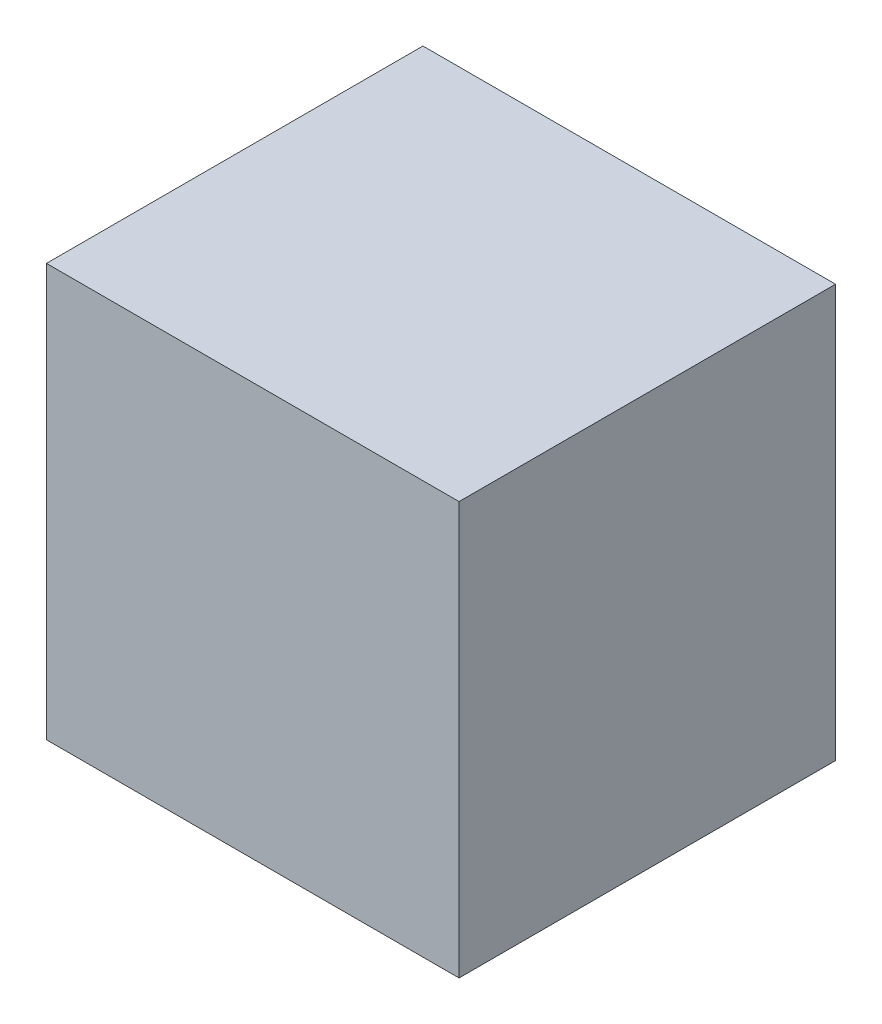
ISO-10303-21;
HEADER;
FILE_DESCRIPTION(('STEP AP214'),'2;1');
FILE_NAME('part.step','',(''),(''),'','','');
FILE_SCHEMA(('AUTOMOTIVE_DESIGN { 1 0 10303 214 1 1 1 1 }'));
ENDSEC;
DATA;
#1=APPLICATION_CONTEXT('core data for automotive mechanical design processes');
#2=APPLICATION_PROTOCOL_DEFINITION('international standard','automotive_design',2000,#1);
#3=PRODUCT_CONTEXT('',#1,'mechanical');
#4=PRODUCT('Part','Part','',(#3));
#5=PRODUCT_RELATED_PRODUCT_CATEGORY('part','',(#4));
#6=PRODUCT_DEFINITION_FORMATION('','',#4);
#7=PRODUCT_DEFINITION_CONTEXT('part definition',#1,'design');
#8=PRODUCT_DEFINITION('design','',#6,#7);
#9=PRODUCT_DEFINITION_SHAPE('','',#8);
#10=(LENGTH_UNIT() NAMED_UNIT(*) SI_UNIT(.MILLI.,.METRE.));
#11=(NAMED_UNIT(*) PLANE_ANGLE_UNIT() SI_UNIT($,.RADIAN.));
#12=(NAMED_UNIT(*) SI_UNIT($,.STERADIAN.) SOLID_ANGLE_UNIT());
#13=UNCERTAINTY_MEASURE_WITH_UNIT(LENGTH_MEASURE(1.E-05),#10,'distance_accuracy_value','');
#14=(GEOMETRIC_REPRESENTATION_CONTEXT(3) GLOBAL_UNCERTAINTY_ASSIGNED_CONTEXT((#13)) GLOBAL_UNIT_ASSIGNED_CONTEXT((#10,
#11,#12)) REPRESENTATION_CONTEXT('',''));
#15=CARTESIAN_POINT('',(0.,0.,0.));
#16=DIRECTION('',(0.,0.,1.));
#17=DIRECTION('',(1.,0.,0.));
#18=AXIS2_PLACEMENT_3D('',#15,#16,#17);
#19=CARTESIAN_POINT('',(0.,254.,0.));
#20=DIRECTION('',(1.,0.,0.));
#21=DIRECTION('',(0.,0.,-1.));
#22=AXIS2_PLACEMENT_3D('',#19,#20,#21);
#23=PLANE('',#22);
#24=DIRECTION('',(0.,0.,1.));
#25=VECTOR('',#24,1.);
#26=CARTESIAN_POINT('',(0.,0.,0.));
#27=LINE('',#26,#25);
#28=CARTESIAN_POINT('',(0.,0.,-231.775));
#29=VERTEX_POINT('',#28);
#30=CARTESIAN_POINT('',(0.,0.,0.));
#31=VERTEX_POINT('',#30);
#32=EDGE_CURVE('E96',#29,#31,#27,.T.);
#33=ORIENTED_EDGE('',*,*,#32,.T.);
#34=DIRECTION('',(0.,-1.,0.));
#35=VECTOR('',#34,1.);
#36=CARTESIAN_POINT('',(0.,254.,0.));
#37=LINE('',#36,#35);
#38=CARTESIAN_POINT('',(0.,254.,0.));
#39=VERTEX_POINT('',#38);
#40=EDGE_CURVE('E11',#39,#31,#37,.T.);
#41=ORIENTED_EDGE('',*,*,#40,.F.);
#42=DIRECTION('',(0.,0.,1.));
#43=VECTOR('',#42,1.);
#44=CARTESIAN_POINT('',(0.,254.,0.));
#45=LINE('',#44,#43);
#46=CARTESIAN_POINT('',(0.,254.,-231.775));
#47=VERTEX_POINT('',#46);
#48=EDGE_CURVE('E84',#47,#39,#45,.T.);
#49=ORIENTED_EDGE('',*,*,#48,.F.);
#50=DIRECTION('',(0.,-1.,0.));
#51=VECTOR('',#50,1.);
#52=CARTESIAN_POINT('',(0.,254.,-231.775));
#53=LINE('',#52,#51);
#54=EDGE_CURVE('E92',#47,#29,#53,.T.);
#55=ORIENTED_EDGE('',*,*,#54,.T.);
#56=EDGE_LOOP('',(#33,#41,#49,#55));
#57=FACE_BOUND('',#56,.T.);
#58=ADVANCED_FACE('F33',(#57),#23,.F.);
#59=CARTESIAN_POINT('',(0.,254.,0.));
#60=DIRECTION('',(0.,0.,-1.));
#61=DIRECTION('',(-1.,0.,0.));
#62=AXIS2_PLACEMENT_3D('',#59,#60,#61);
#63=PLANE('',#62);
#64=DIRECTION('',(1.,0.,0.));
#65=VECTOR('',#64,1.);
#66=CARTESIAN_POINT('',(0.,0.,0.));
#67=LINE('',#66,#65);
#68=CARTESIAN_POINT('',(254.,0.,0.));
#69=VERTEX_POINT('',#68);
#70=EDGE_CURVE('E88',#31,#69,#67,.T.);
#71=ORIENTED_EDGE('',*,*,#70,.T.);
#72=DIRECTION('',(0.,-1.,0.));
#73=VECTOR('',#72,1.);
#74=CARTESIAN_POINT('',(254.,254.,0.));
#75=LINE('',#74,#73);
#76=CARTESIAN_POINT('',(254.,254.,0.));
#77=VERTEX_POINT('',#76);
#78=EDGE_CURVE('E41',#77,#69,#75,.T.);
#79=ORIENTED_EDGE('',*,*,#78,.F.);
#80=DIRECTION('',(1.,0.,0.));
#81=VECTOR('',#80,1.);
#82=CARTESIAN_POINT('',(0.,254.,0.));
#83=LINE('',#82,#81);
#84=EDGE_CURVE('E79',#39,#77,#83,.T.);
#85=ORIENTED_EDGE('',*,*,#84,.F.);
#86=ORIENTED_EDGE('',*,*,#40,.T.);
#87=EDGE_LOOP('',(#71,#79,#85,#86));
#88=FACE_BOUND('',#87,.T.);
#89=ADVANCED_FACE('F87',(#88),#63,.F.);
#90=CARTESIAN_POINT('',(254.,254.,0.));
#91=DIRECTION('',(-1.,0.,0.));
#92=DIRECTION('',(0.,0.,1.));
#93=AXIS2_PLACEMENT_3D('',#90,#91,#92);
#94=PLANE('',#93);
#95=DIRECTION('',(0.,0.,-1.));
#96=VECTOR('',#95,1.);
#97=CARTESIAN_POINT('',(254.,0.,0.));
#98=LINE('',#97,#96);
#99=CARTESIAN_POINT('',(254.,0.,-231.775));
#100=VERTEX_POINT('',#99);
#101=EDGE_CURVE('E66',#69,#100,#98,.T.);
#102=ORIENTED_EDGE('',*,*,#101,.T.);
#103=DIRECTION('',(0.,-1.,0.));
#104=VECTOR('',#103,1.);
#105=CARTESIAN_POINT('',(254.,254.,-231.775));
#106=LINE('',#105,#104);
#107=CARTESIAN_POINT('',(254.,254.,-231.775));
#108=VERTEX_POINT('',#107);
#109=EDGE_CURVE('E89',#108,#100,#106,.T.);
#110=ORIENTED_EDGE('',*,*,#109,.F.);
#111=DIRECTION('',(0.,0.,-1.));
#112=VECTOR('',#111,1.);
#113=CARTESIAN_POINT('',(254.,254.,0.));
#114=LINE('',#113,#112);
#115=EDGE_CURVE('E82',#77,#108,#114,.T.);
#116=ORIENTED_EDGE('',*,*,#115,.F.);
#117=ORIENTED_EDGE('',*,*,#78,.T.);
#118=EDGE_LOOP('',(#102,#110,#116,#117));
#119=FACE_BOUND('',#118,.T.);
#120=ADVANCED_FACE('F90',(#119),#94,.F.);
#121=CARTESIAN_POINT('',(0.,254.,-231.775));
#122=DIRECTION('',(0.,0.,1.));
#123=DIRECTION('',(1.,0.,0.));
#124=AXIS2_PLACEMENT_3D('',#121,#122,#123);
#125=PLANE('',#124);
#126=DIRECTION('',(-1.,0.,0.));
#127=VECTOR('',#126,1.);
#128=CARTESIAN_POINT('',(0.,0.,-231.775));
#129=LINE('',#128,#127);
#130=EDGE_CURVE('E72',#100,#29,#129,.T.);
#131=ORIENTED_EDGE('',*,*,#130,.T.);
#132=ORIENTED_EDGE('',*,*,#54,.F.);
#133=DIRECTION('',(-1.,0.,0.));
#134=VECTOR('',#133,1.);
#135=CARTESIAN_POINT('',(0.,254.,-231.775));
#136=LINE('',#135,#134);
#137=EDGE_CURVE('E49',#108,#47,#136,.T.);
#138=ORIENTED_EDGE('',*,*,#137,.F.);
#139=ORIENTED_EDGE('',*,*,#109,.T.);
#140=EDGE_LOOP('',(#131,#132,#138,#139));
#141=FACE_BOUND('',#140,.T.);
#142=ADVANCED_FACE('F103',(#141),#125,.F.);
#143=CARTESIAN_POINT('',(0.,254.,0.));
#144=DIRECTION('',(0.,-1.,0.));
#145=DIRECTION('',(0.,0.,-1.));
#146=AXIS2_PLACEMENT_3D('',#143,#144,#145);
#147=PLANE('',#146);
#148=ORIENTED_EDGE('',*,*,#48,.T.);
#149=ORIENTED_EDGE('',*,*,#84,.T.);
#150=ORIENTED_EDGE('',*,*,#115,.T.);
#151=ORIENTED_EDGE('',*,*,#137,.T.);
#152=EDGE_LOOP('',(#148,#149,#150,#151));
#153=FACE_BOUND('',#152,.T.);
#154=ADVANCED_FACE('F80',(#153),#147,.F.);
#155=CARTESIAN_POINT('',(0.,0.,0.));
#156=DIRECTION('',(0.,-1.,0.));
#157=DIRECTION('',(0.,0.,-1.));
#158=AXIS2_PLACEMENT_3D('',#155,#156,#157);
#159=PLANE('',#158);
#160=ORIENTED_EDGE('',*,*,#32,.F.);
#161=ORIENTED_EDGE('',*,*,#130,.F.);
#162=ORIENTED_EDGE('',*,*,#101,.F.);
#163=ORIENTED_EDGE('',*,*,#70,.F.);
#164=EDGE_LOOP('',(#160,#161,#162,#163));
#165=FACE_BOUND('',#164,.T.);
#166=ADVANCED_FACE('F106',(#165),#159,.T.);
#167=CLOSED_SHELL('',(#58,#89,#120,#142,#154,#166));
#168=MANIFOLD_SOLID_BREP('B2',#167);
#169=ADVANCED_BREP_SHAPE_REPRESENTATION('',(#18,#168),#14);
#170=SHAPE_DEFINITION_REPRESENTATION(#9,#169);
ENDSEC;
END-ISO-10303-21;
